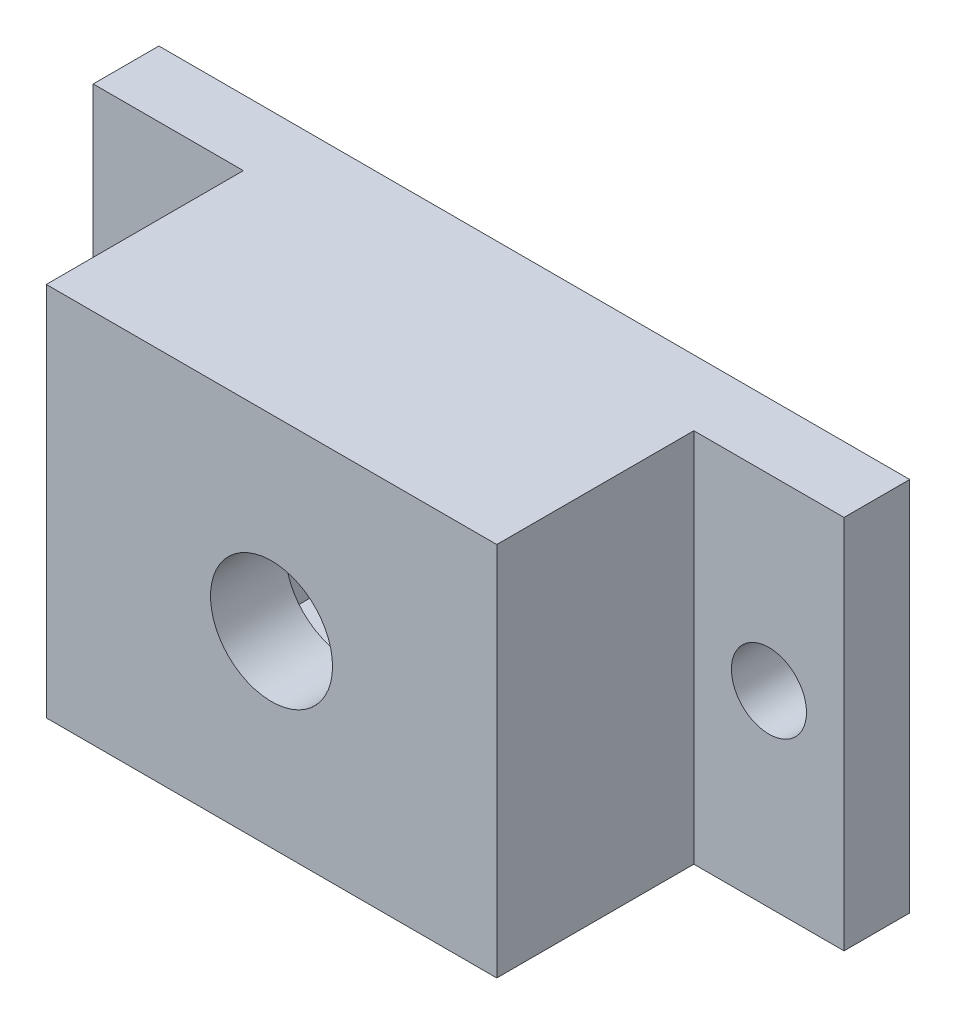
ISO-10303-21;
HEADER;
FILE_DESCRIPTION(('STEP AP214'),'2;1');
FILE_NAME('part.step','',(''),(''),'','','');
FILE_SCHEMA(('AUTOMOTIVE_DESIGN { 1 0 10303 214 1 1 1 1 }'));
ENDSEC;
DATA;
#1=APPLICATION_CONTEXT('core data for automotive mechanical design processes');
#2=APPLICATION_PROTOCOL_DEFINITION('international standard','automotive_design',2000,#1);
#3=PRODUCT_CONTEXT('',#1,'mechanical');
#4=PRODUCT('Part','Part','',(#3));
#5=PRODUCT_RELATED_PRODUCT_CATEGORY('part','',(#4));
#6=PRODUCT_DEFINITION_FORMATION('','',#4);
#7=PRODUCT_DEFINITION_CONTEXT('part definition',#1,'design');
#8=PRODUCT_DEFINITION('design','',#6,#7);
#9=PRODUCT_DEFINITION_SHAPE('','',#8);
#10=(LENGTH_UNIT() NAMED_UNIT(*) SI_UNIT(.MILLI.,.METRE.));
#11=(NAMED_UNIT(*) PLANE_ANGLE_UNIT() SI_UNIT($,.RADIAN.));
#12=(NAMED_UNIT(*) SI_UNIT($,.STERADIAN.) SOLID_ANGLE_UNIT());
#13=UNCERTAINTY_MEASURE_WITH_UNIT(LENGTH_MEASURE(1.E-05),#10,'distance_accuracy_value','');
#14=(GEOMETRIC_REPRESENTATION_CONTEXT(3) GLOBAL_UNCERTAINTY_ASSIGNED_CONTEXT((#13)) GLOBAL_UNIT_ASSIGNED_CONTEXT((#10,
#11,#12)) REPRESENTATION_CONTEXT('',''));
#15=CARTESIAN_POINT('',(0.,0.,0.));
#16=DIRECTION('',(0.,0.,1.));
#17=DIRECTION('',(1.,0.,0.));
#18=AXIS2_PLACEMENT_3D('',#15,#16,#17);
#19=CARTESIAN_POINT('',(0.,0.,3.5));
#20=DIRECTION('',(0.,0.,1.));
#21=DIRECTION('',(1.,0.,0.));
#22=AXIS2_PLACEMENT_3D('',#19,#20,#21);
#23=PLANE('',#22);
#24=DIRECTION('',(0.,-1.,0.));
#25=VECTOR('',#24,1.);
#26=CARTESIAN_POINT('',(-53.2000626386215,-3.59073182197579,3.5));
#27=LINE('',#26,#25);
#28=CARTESIAN_POINT('',(-53.2000626386215,16.4092681780242,3.5));
#29=VERTEX_POINT('',#28);
#30=CARTESIAN_POINT('',(-53.2000626386215,-3.59073182197579,3.5));
#31=VERTEX_POINT('',#30);
#32=EDGE_CURVE('E57',#29,#31,#27,.T.);
#33=ORIENTED_EDGE('',*,*,#32,.F.);
#34=DIRECTION('',(-1.,0.,0.));
#35=VECTOR('',#34,1.);
#36=CARTESIAN_POINT('',(-61.2000626386215,16.4092681780242,3.5));
#37=LINE('',#36,#35);
#38=CARTESIAN_POINT('',(-61.2000626386215,16.4092681780242,3.5));
#39=VERTEX_POINT('',#38);
#40=EDGE_CURVE('E210',#29,#39,#37,.T.);
#41=ORIENTED_EDGE('',*,*,#40,.T.);
#42=DIRECTION('',(0.,-1.,0.));
#43=VECTOR('',#42,1.);
#44=CARTESIAN_POINT('',(-61.2000626386215,16.4092681780242,3.5));
#45=LINE('',#44,#43);
#46=CARTESIAN_POINT('',(-61.2000626386215,-3.59073182197579,3.5));
#47=VERTEX_POINT('',#46);
#48=EDGE_CURVE('E201',#39,#47,#45,.T.);
#49=ORIENTED_EDGE('',*,*,#48,.T.);
#50=DIRECTION('',(1.,0.,0.));
#51=VECTOR('',#50,1.);
#52=CARTESIAN_POINT('',(-61.2000626386215,-3.59073182197579,3.5));
#53=LINE('',#52,#51);
#54=EDGE_CURVE('E206',#47,#31,#53,.T.);
#55=ORIENTED_EDGE('',*,*,#54,.T.);
#56=EDGE_LOOP('',(#33,#41,#49,#55));
#57=FACE_BOUND('',#56,.T.);
#58=CARTESIAN_POINT('',(-57.2000626386215,6.40926817802421,3.5));
#59=DIRECTION('',(0.,0.,1.));
#60=DIRECTION('',(1.,0.,0.));
#61=AXIS2_PLACEMENT_3D('',#58,#59,#60);
#62=CIRCLE('',#61,2.);
#63=CARTESIAN_POINT('',(-55.2000626386215,6.40926817802421,3.5));
#64=VERTEX_POINT('',#63);
#65=EDGE_CURVE('E195',#64,#64,#62,.T.);
#66=ORIENTED_EDGE('',*,*,#65,.F.);
#67=EDGE_LOOP('',(#66));
#68=FACE_BOUND('',#67,.T.);
#69=ADVANCED_FACE('F33',(#57,#68),#23,.T.);
#70=DIRECTION('',(0.,1.,0.));
#71=VECTOR('',#70,1.);
#72=CARTESIAN_POINT('',(-29.2000626386215,-3.59073182197579,3.5));
#73=LINE('',#72,#71);
#74=CARTESIAN_POINT('',(-29.2000626386215,-3.59073182197579,3.5));
#75=VERTEX_POINT('',#74);
#76=CARTESIAN_POINT('',(-29.2000626386215,16.4092681780242,3.5));
#77=VERTEX_POINT('',#76);
#78=EDGE_CURVE('E167',#75,#77,#73,.T.);
#79=ORIENTED_EDGE('',*,*,#78,.F.);
#80=CARTESIAN_POINT('',(-21.2000626386215,-3.59073182197579,3.5));
#81=VERTEX_POINT('',#80);
#82=EDGE_CURVE('E204',#75,#81,#53,.T.);
#83=ORIENTED_EDGE('',*,*,#82,.T.);
#84=DIRECTION('',(0.,1.,0.));
#85=VECTOR('',#84,1.);
#86=CARTESIAN_POINT('',(-21.2000626386215,16.4092681780242,3.5));
#87=LINE('',#86,#85);
#88=CARTESIAN_POINT('',(-21.2000626386215,16.4092681780242,3.5));
#89=VERTEX_POINT('',#88);
#90=EDGE_CURVE('E208',#81,#89,#87,.T.);
#91=ORIENTED_EDGE('',*,*,#90,.T.);
#92=EDGE_CURVE('E211',#89,#77,#37,.T.);
#93=ORIENTED_EDGE('',*,*,#92,.T.);
#94=EDGE_LOOP('',(#79,#83,#91,#93));
#95=FACE_BOUND('',#94,.T.);
#96=CARTESIAN_POINT('',(-25.2000626386215,6.40926817802421,3.5));
#97=DIRECTION('',(0.,0.,1.));
#98=DIRECTION('',(1.,0.,0.));
#99=AXIS2_PLACEMENT_3D('',#96,#97,#98);
#100=CIRCLE('',#99,2.);
#101=CARTESIAN_POINT('',(-23.2000626386215,6.40926817802421,3.5));
#102=VERTEX_POINT('',#101);
#103=EDGE_CURVE('E189',#102,#102,#100,.T.);
#104=ORIENTED_EDGE('',*,*,#103,.F.);
#105=EDGE_LOOP('',(#104));
#106=FACE_BOUND('',#105,.T.);
#107=ADVANCED_FACE('F262',(#95,#106),#23,.T.);
#108=CARTESIAN_POINT('',(0.,0.,0.));
#109=DIRECTION('',(0.,0.,1.));
#110=DIRECTION('',(1.,0.,0.));
#111=AXIS2_PLACEMENT_3D('',#108,#109,#110);
#112=PLANE('',#111);
#113=DIRECTION('',(1.,0.,0.));
#114=VECTOR('',#113,1.);
#115=CARTESIAN_POINT('',(-50.2000626386215,14.9092681780242,0.));
#116=LINE('',#115,#114);
#117=CARTESIAN_POINT('',(-50.2000626386215,14.9092681780242,0.));
#118=VERTEX_POINT('',#117);
#119=CARTESIAN_POINT('',(-32.2000626386215,14.9092681780242,0.));
#120=VERTEX_POINT('',#119);
#121=EDGE_CURVE('E154',#118,#120,#116,.T.);
#122=ORIENTED_EDGE('',*,*,#121,.F.);
#123=DIRECTION('',(0.,1.,0.));
#124=VECTOR('',#123,1.);
#125=CARTESIAN_POINT('',(-50.2000626386215,14.9092681780242,0.));
#126=LINE('',#125,#124);
#127=CARTESIAN_POINT('',(-50.2000626386215,-2.09073182197579,0.));
#128=VERTEX_POINT('',#127);
#129=EDGE_CURVE('E49',#128,#118,#126,.T.);
#130=ORIENTED_EDGE('',*,*,#129,.F.);
#131=DIRECTION('',(-1.,0.,0.));
#132=VECTOR('',#131,1.);
#133=CARTESIAN_POINT('',(-50.2000626386215,-2.09073182197579,0.));
#134=LINE('',#133,#132);
#135=CARTESIAN_POINT('',(-32.2000626386215,-2.0907318219758,0.));
#136=VERTEX_POINT('',#135);
#137=EDGE_CURVE('E143',#136,#128,#134,.T.);
#138=ORIENTED_EDGE('',*,*,#137,.F.);
#139=DIRECTION('',(0.,-1.,0.));
#140=VECTOR('',#139,1.);
#141=CARTESIAN_POINT('',(-32.2000626386215,14.9092681780242,0.));
#142=LINE('',#141,#140);
#143=EDGE_CURVE('E146',#120,#136,#142,.T.);
#144=ORIENTED_EDGE('',*,*,#143,.F.);
#145=EDGE_LOOP('',(#122,#130,#138,#144));
#146=FACE_BOUND('',#145,.T.);
#147=DIRECTION('',(0.,-1.,0.));
#148=VECTOR('',#147,1.);
#149=CARTESIAN_POINT('',(-61.2000626386215,16.4092681780242,0.));
#150=LINE('',#149,#148);
#151=CARTESIAN_POINT('',(-61.2000626386215,16.4092681780242,0.));
#152=VERTEX_POINT('',#151);
#153=CARTESIAN_POINT('',(-61.2000626386215,-3.59073182197579,0.));
#154=VERTEX_POINT('',#153);
#155=EDGE_CURVE('E198',#152,#154,#150,.T.);
#156=ORIENTED_EDGE('',*,*,#155,.F.);
#157=DIRECTION('',(-1.,0.,0.));
#158=VECTOR('',#157,1.);
#159=CARTESIAN_POINT('',(-61.2000626386215,16.4092681780242,0.));
#160=LINE('',#159,#158);
#161=CARTESIAN_POINT('',(-21.2000626386215,16.4092681780242,0.));
#162=VERTEX_POINT('',#161);
#163=EDGE_CURVE('E205',#162,#152,#160,.T.);
#164=ORIENTED_EDGE('',*,*,#163,.F.);
#165=DIRECTION('',(0.,1.,0.));
#166=VECTOR('',#165,1.);
#167=CARTESIAN_POINT('',(-21.2000626386215,16.4092681780242,0.));
#168=LINE('',#167,#166);
#169=CARTESIAN_POINT('',(-21.2000626386215,-3.59073182197579,0.));
#170=VERTEX_POINT('',#169);
#171=EDGE_CURVE('E218',#170,#162,#168,.T.);
#172=ORIENTED_EDGE('',*,*,#171,.F.);
#173=DIRECTION('',(1.,0.,0.));
#174=VECTOR('',#173,1.);
#175=CARTESIAN_POINT('',(-61.2000626386215,-3.59073182197579,0.));
#176=LINE('',#175,#174);
#177=EDGE_CURVE('E216',#154,#170,#176,.T.);
#178=ORIENTED_EDGE('',*,*,#177,.F.);
#179=EDGE_LOOP('',(#156,#164,#172,#178));
#180=FACE_BOUND('',#179,.T.);
#181=CARTESIAN_POINT('',(-57.2000626386215,6.40926817802421,0.));
#182=DIRECTION('',(0.,0.,1.));
#183=DIRECTION('',(1.,0.,0.));
#184=AXIS2_PLACEMENT_3D('',#181,#182,#183);
#185=CIRCLE('',#184,2.);
#186=CARTESIAN_POINT('',(-55.2000626386215,6.40926817802421,0.));
#187=VERTEX_POINT('',#186);
#188=EDGE_CURVE('E192',#187,#187,#185,.T.);
#189=ORIENTED_EDGE('',*,*,#188,.T.);
#190=EDGE_LOOP('',(#189));
#191=FACE_BOUND('',#190,.T.);
#192=CARTESIAN_POINT('',(-25.2000626386215,6.40926817802421,0.));
#193=DIRECTION('',(0.,0.,1.));
#194=DIRECTION('',(1.,0.,0.));
#195=AXIS2_PLACEMENT_3D('',#192,#193,#194);
#196=CIRCLE('',#195,2.);
#197=CARTESIAN_POINT('',(-23.2000626386215,6.40926817802421,0.));
#198=VERTEX_POINT('',#197);
#199=EDGE_CURVE('E188',#198,#198,#196,.T.);
#200=ORIENTED_EDGE('',*,*,#199,.T.);
#201=EDGE_LOOP('',(#200));
#202=FACE_BOUND('',#201,.T.);
#203=ADVANCED_FACE('F238',(#146,#180,#191,#202),#112,.F.);
#204=CARTESIAN_POINT('',(-61.2000626386215,16.4092681780242,3.5));
#205=DIRECTION('',(1.,0.,0.));
#206=DIRECTION('',(0.,0.,-1.));
#207=AXIS2_PLACEMENT_3D('',#204,#205,#206);
#208=PLANE('',#207);
#209=ORIENTED_EDGE('',*,*,#155,.T.);
#210=DIRECTION('',(0.,0.,-1.));
#211=VECTOR('',#210,1.);
#212=CARTESIAN_POINT('',(-61.2000626386215,-3.59073182197579,3.5));
#213=LINE('',#212,#211);
#214=EDGE_CURVE('E11',#47,#154,#213,.T.);
#215=ORIENTED_EDGE('',*,*,#214,.F.);
#216=ORIENTED_EDGE('',*,*,#48,.F.);
#217=DIRECTION('',(0.,0.,-1.));
#218=VECTOR('',#217,1.);
#219=CARTESIAN_POINT('',(-61.2000626386215,16.4092681780242,3.5));
#220=LINE('',#219,#218);
#221=EDGE_CURVE('E213',#39,#152,#220,.T.);
#222=ORIENTED_EDGE('',*,*,#221,.T.);
#223=EDGE_LOOP('',(#209,#215,#216,#222));
#224=FACE_BOUND('',#223,.T.);
#225=ADVANCED_FACE('F35',(#224),#208,.F.);
#226=CARTESIAN_POINT('',(-61.2000626386215,-3.59073182197579,3.5));
#227=DIRECTION('',(0.,1.,0.));
#228=DIRECTION('',(-1.,0.,0.));
#229=AXIS2_PLACEMENT_3D('',#226,#227,#228);
#230=PLANE('',#229);
#231=ORIENTED_EDGE('',*,*,#177,.T.);
#232=DIRECTION('',(0.,0.,-1.));
#233=VECTOR('',#232,1.);
#234=CARTESIAN_POINT('',(-21.2000626386215,-3.59073182197579,3.5));
#235=LINE('',#234,#233);
#236=EDGE_CURVE('E42',#81,#170,#235,.T.);
#237=ORIENTED_EDGE('',*,*,#236,.F.);
#238=ORIENTED_EDGE('',*,*,#82,.F.);
#239=DIRECTION('',(0.,0.,-1.));
#240=VECTOR('',#239,1.);
#241=CARTESIAN_POINT('',(-29.2000626386215,-3.59073182197579,14.));
#242=LINE('',#241,#240);
#243=CARTESIAN_POINT('',(-29.2000626386215,-3.59073182197579,14.));
#244=VERTEX_POINT('',#243);
#245=EDGE_CURVE('E182',#244,#75,#242,.T.);
#246=ORIENTED_EDGE('',*,*,#245,.F.);
#247=DIRECTION('',(1.,0.,0.));
#248=VECTOR('',#247,1.);
#249=CARTESIAN_POINT('',(-53.2000626386215,-3.59073182197579,14.));
#250=LINE('',#249,#248);
#251=CARTESIAN_POINT('',(-53.2000626386215,-3.59073182197579,14.));
#252=VERTEX_POINT('',#251);
#253=EDGE_CURVE('E166',#252,#244,#250,.T.);
#254=ORIENTED_EDGE('',*,*,#253,.F.);
#255=DIRECTION('',(0.,0.,-1.));
#256=VECTOR('',#255,1.);
#257=CARTESIAN_POINT('',(-53.2000626386215,-3.59073182197579,14.));
#258=LINE('',#257,#256);
#259=EDGE_CURVE('E185',#252,#31,#258,.T.);
#260=ORIENTED_EDGE('',*,*,#259,.T.);
#261=ORIENTED_EDGE('',*,*,#54,.F.);
#262=ORIENTED_EDGE('',*,*,#214,.T.);
#263=EDGE_LOOP('',(#231,#237,#238,#246,#254,#260,#261,#262));
#264=FACE_BOUND('',#263,.T.);
#265=ADVANCED_FACE('F264',(#264),#230,.F.);
#266=CARTESIAN_POINT('',(-21.2000626386215,16.4092681780242,3.5));
#267=DIRECTION('',(-1.,0.,0.));
#268=DIRECTION('',(0.,0.,1.));
#269=AXIS2_PLACEMENT_3D('',#266,#267,#268);
#270=PLANE('',#269);
#271=ORIENTED_EDGE('',*,*,#171,.T.);
#272=DIRECTION('',(0.,0.,-1.));
#273=VECTOR('',#272,1.);
#274=CARTESIAN_POINT('',(-21.2000626386215,16.4092681780242,3.5));
#275=LINE('',#274,#273);
#276=EDGE_CURVE('E223',#89,#162,#275,.T.);
#277=ORIENTED_EDGE('',*,*,#276,.F.);
#278=ORIENTED_EDGE('',*,*,#90,.F.);
#279=ORIENTED_EDGE('',*,*,#236,.T.);
#280=EDGE_LOOP('',(#271,#277,#278,#279));
#281=FACE_BOUND('',#280,.T.);
#282=ADVANCED_FACE('F231',(#281),#270,.F.);
#283=CARTESIAN_POINT('',(-61.2000626386215,16.4092681780242,3.5));
#284=DIRECTION('',(0.,-1.,0.));
#285=DIRECTION('',(0.,0.,-1.));
#286=AXIS2_PLACEMENT_3D('',#283,#284,#285);
#287=PLANE('',#286);
#288=ORIENTED_EDGE('',*,*,#163,.T.);
#289=ORIENTED_EDGE('',*,*,#221,.F.);
#290=ORIENTED_EDGE('',*,*,#40,.F.);
#291=DIRECTION('',(0.,0.,-1.));
#292=VECTOR('',#291,1.);
#293=CARTESIAN_POINT('',(-53.2000626386215,16.4092681780242,14.));
#294=LINE('',#293,#292);
#295=CARTESIAN_POINT('',(-53.2000626386215,16.4092681780242,14.));
#296=VERTEX_POINT('',#295);
#297=EDGE_CURVE('E173',#296,#29,#294,.T.);
#298=ORIENTED_EDGE('',*,*,#297,.F.);
#299=DIRECTION('',(-1.,0.,0.));
#300=VECTOR('',#299,1.);
#301=CARTESIAN_POINT('',(-53.2000626386215,16.4092681780242,14.));
#302=LINE('',#301,#300);
#303=CARTESIAN_POINT('',(-29.2000626386215,16.4092681780242,14.));
#304=VERTEX_POINT('',#303);
#305=EDGE_CURVE('E171',#304,#296,#302,.T.);
#306=ORIENTED_EDGE('',*,*,#305,.F.);
#307=DIRECTION('',(0.,0.,-1.));
#308=VECTOR('',#307,1.);
#309=CARTESIAN_POINT('',(-29.2000626386215,16.4092681780242,14.));
#310=LINE('',#309,#308);
#311=EDGE_CURVE('E179',#304,#77,#310,.T.);
#312=ORIENTED_EDGE('',*,*,#311,.T.);
#313=ORIENTED_EDGE('',*,*,#92,.F.);
#314=ORIENTED_EDGE('',*,*,#276,.T.);
#315=EDGE_LOOP('',(#288,#289,#290,#298,#306,#312,#313,#314));
#316=FACE_BOUND('',#315,.T.);
#317=ADVANCED_FACE('F242',(#316),#287,.F.);
#318=CARTESIAN_POINT('',(-57.2000626386215,6.40926817802421,3.5));
#319=DIRECTION('',(0.,0.,-1.));
#320=DIRECTION('',(-1.,0.,0.));
#321=AXIS2_PLACEMENT_3D('',#318,#319,#320);
#322=CYLINDRICAL_SURFACE('',#321,2.);
#323=ORIENTED_EDGE('',*,*,#65,.T.);
#324=EDGE_LOOP('',(#323));
#325=FACE_BOUND('',#324,.T.);
#326=ORIENTED_EDGE('',*,*,#188,.F.);
#327=EDGE_LOOP('',(#326));
#328=FACE_BOUND('',#327,.T.);
#329=ADVANCED_FACE('F278',(#325,#328),#322,.F.);
#330=CARTESIAN_POINT('',(-25.2000626386215,6.40926817802421,3.5));
#331=DIRECTION('',(0.,0.,-1.));
#332=DIRECTION('',(-1.,0.,0.));
#333=AXIS2_PLACEMENT_3D('',#330,#331,#332);
#334=CYLINDRICAL_SURFACE('',#333,2.);
#335=ORIENTED_EDGE('',*,*,#103,.T.);
#336=EDGE_LOOP('',(#335));
#337=FACE_BOUND('',#336,.T.);
#338=ORIENTED_EDGE('',*,*,#199,.F.);
#339=EDGE_LOOP('',(#338));
#340=FACE_BOUND('',#339,.T.);
#341=ADVANCED_FACE('F287',(#337,#340),#334,.F.);
#342=CARTESIAN_POINT('',(-53.2000626386215,-3.59073182197579,14.));
#343=DIRECTION('',(1.,0.,0.));
#344=DIRECTION('',(0.,0.,-1.));
#345=AXIS2_PLACEMENT_3D('',#342,#343,#344);
#346=PLANE('',#345);
#347=ORIENTED_EDGE('',*,*,#32,.T.);
#348=ORIENTED_EDGE('',*,*,#259,.F.);
#349=DIRECTION('',(0.,-1.,0.));
#350=VECTOR('',#349,1.);
#351=CARTESIAN_POINT('',(-53.2000626386215,-3.59073182197579,14.));
#352=LINE('',#351,#350);
#353=EDGE_CURVE('E163',#296,#252,#352,.T.);
#354=ORIENTED_EDGE('',*,*,#353,.F.);
#355=ORIENTED_EDGE('',*,*,#297,.T.);
#356=EDGE_LOOP('',(#347,#348,#354,#355));
#357=FACE_BOUND('',#356,.T.);
#358=ADVANCED_FACE('F252',(#357),#346,.F.);
#359=CARTESIAN_POINT('',(-29.2000626386215,-3.59073182197579,14.));
#360=DIRECTION('',(-1.,0.,0.));
#361=DIRECTION('',(0.,0.,1.));
#362=AXIS2_PLACEMENT_3D('',#359,#360,#361);
#363=PLANE('',#362);
#364=ORIENTED_EDGE('',*,*,#78,.T.);
#365=ORIENTED_EDGE('',*,*,#311,.F.);
#366=DIRECTION('',(0.,1.,0.));
#367=VECTOR('',#366,1.);
#368=CARTESIAN_POINT('',(-29.2000626386215,-3.59073182197579,14.));
#369=LINE('',#368,#367);
#370=EDGE_CURVE('E169',#244,#304,#369,.T.);
#371=ORIENTED_EDGE('',*,*,#370,.F.);
#372=ORIENTED_EDGE('',*,*,#245,.T.);
#373=EDGE_LOOP('',(#364,#365,#371,#372));
#374=FACE_BOUND('',#373,.T.);
#375=ADVANCED_FACE('F260',(#374),#363,.F.);
#376=CARTESIAN_POINT('',(0.,0.,14.));
#377=DIRECTION('',(0.,0.,-1.));
#378=DIRECTION('',(-1.,0.,0.));
#379=AXIS2_PLACEMENT_3D('',#376,#377,#378);
#380=PLANE('',#379);
#381=CARTESIAN_POINT('',(-41.2000626386215,6.40926817802421,14.));
#382=DIRECTION('',(0.,0.,1.));
#383=DIRECTION('',(1.,0.,0.));
#384=AXIS2_PLACEMENT_3D('',#381,#382,#383);
#385=CIRCLE('',#384,3.25);
#386=CARTESIAN_POINT('',(-37.9500626386215,6.40926817802421,14.));
#387=VERTEX_POINT('',#386);
#388=EDGE_CURVE('E149',#387,#387,#385,.T.);
#389=ORIENTED_EDGE('',*,*,#388,.F.);
#390=EDGE_LOOP('',(#389));
#391=FACE_BOUND('',#390,.T.);
#392=ORIENTED_EDGE('',*,*,#353,.T.);
#393=ORIENTED_EDGE('',*,*,#253,.T.);
#394=ORIENTED_EDGE('',*,*,#370,.T.);
#395=ORIENTED_EDGE('',*,*,#305,.T.);
#396=EDGE_LOOP('',(#392,#393,#394,#395));
#397=FACE_BOUND('',#396,.T.);
#398=ADVANCED_FACE('F255',(#391,#397),#380,.F.);
#399=CARTESIAN_POINT('',(-50.2000626386215,14.9092681780242,10.));
#400=DIRECTION('',(-1.,0.,0.));
#401=DIRECTION('',(0.,0.,1.));
#402=AXIS2_PLACEMENT_3D('',#399,#400,#401);
#403=PLANE('',#402);
#404=ORIENTED_EDGE('',*,*,#129,.T.);
#405=DIRECTION('',(0.,0.,-1.));
#406=VECTOR('',#405,1.);
#407=CARTESIAN_POINT('',(-50.2000626386215,14.9092681780242,10.));
#408=LINE('',#407,#406);
#409=CARTESIAN_POINT('',(-50.2000626386215,14.9092681780242,10.));
#410=VERTEX_POINT('',#409);
#411=EDGE_CURVE('E121',#410,#118,#408,.T.);
#412=ORIENTED_EDGE('',*,*,#411,.F.);
#413=DIRECTION('',(0.,1.,0.));
#414=VECTOR('',#413,1.);
#415=CARTESIAN_POINT('',(-50.2000626386215,14.9092681780242,10.));
#416=LINE('',#415,#414);
#417=CARTESIAN_POINT('',(-50.2000626386215,-2.09073182197579,10.));
#418=VERTEX_POINT('',#417);
#419=EDGE_CURVE('E125',#418,#410,#416,.T.);
#420=ORIENTED_EDGE('',*,*,#419,.F.);
#421=DIRECTION('',(0.,0.,-1.));
#422=VECTOR('',#421,1.);
#423=CARTESIAN_POINT('',(-50.2000626386215,-2.09073182197579,10.));
#424=LINE('',#423,#422);
#425=EDGE_CURVE('E158',#418,#128,#424,.T.);
#426=ORIENTED_EDGE('',*,*,#425,.T.);
#427=EDGE_LOOP('',(#404,#412,#420,#426));
#428=FACE_BOUND('',#427,.T.);
#429=ADVANCED_FACE('F123',(#428),#403,.F.);
#430=CARTESIAN_POINT('',(-50.2000626386215,-2.09073182197579,10.));
#431=DIRECTION('',(0.,-1.,0.));
#432=DIRECTION('',(1.,0.,0.));
#433=AXIS2_PLACEMENT_3D('',#430,#431,#432);
#434=PLANE('',#433);
#435=ORIENTED_EDGE('',*,*,#137,.T.);
#436=ORIENTED_EDGE('',*,*,#425,.F.);
#437=DIRECTION('',(-1.,0.,0.));
#438=VECTOR('',#437,1.);
#439=CARTESIAN_POINT('',(-50.2000626386215,-2.09073182197579,10.));
#440=LINE('',#439,#438);
#441=CARTESIAN_POINT('',(-32.2000626386215,-2.0907318219758,10.));
#442=VERTEX_POINT('',#441);
#443=EDGE_CURVE('E131',#442,#418,#440,.T.);
#444=ORIENTED_EDGE('',*,*,#443,.F.);
#445=DIRECTION('',(0.,0.,-1.));
#446=VECTOR('',#445,1.);
#447=CARTESIAN_POINT('',(-32.2000626386215,-2.0907318219758,10.));
#448=LINE('',#447,#446);
#449=EDGE_CURVE('E160',#442,#136,#448,.T.);
#450=ORIENTED_EDGE('',*,*,#449,.T.);
#451=EDGE_LOOP('',(#435,#436,#444,#450));
#452=FACE_BOUND('',#451,.T.);
#453=ADVANCED_FACE('F311',(#452),#434,.F.);
#454=CARTESIAN_POINT('',(-32.2000626386215,14.9092681780242,10.));
#455=DIRECTION('',(1.,0.,0.));
#456=DIRECTION('',(0.,0.,-1.));
#457=AXIS2_PLACEMENT_3D('',#454,#455,#456);
#458=PLANE('',#457);
#459=ORIENTED_EDGE('',*,*,#143,.T.);
#460=ORIENTED_EDGE('',*,*,#449,.F.);
#461=DIRECTION('',(0.,-1.,0.));
#462=VECTOR('',#461,1.);
#463=CARTESIAN_POINT('',(-32.2000626386215,14.9092681780242,10.));
#464=LINE('',#463,#462);
#465=CARTESIAN_POINT('',(-32.2000626386215,14.9092681780242,10.));
#466=VERTEX_POINT('',#465);
#467=EDGE_CURVE('E139',#466,#442,#464,.T.);
#468=ORIENTED_EDGE('',*,*,#467,.F.);
#469=DIRECTION('',(0.,0.,-1.));
#470=VECTOR('',#469,1.);
#471=CARTESIAN_POINT('',(-32.2000626386215,14.9092681780242,10.));
#472=LINE('',#471,#470);
#473=EDGE_CURVE('E130',#466,#120,#472,.T.);
#474=ORIENTED_EDGE('',*,*,#473,.T.);
#475=EDGE_LOOP('',(#459,#460,#468,#474));
#476=FACE_BOUND('',#475,.T.);
#477=ADVANCED_FACE('F314',(#476),#458,.F.);
#478=CARTESIAN_POINT('',(-50.2000626386215,14.9092681780242,10.));
#479=DIRECTION('',(0.,1.,0.));
#480=DIRECTION('',(0.,0.,1.));
#481=AXIS2_PLACEMENT_3D('',#478,#479,#480);
#482=PLANE('',#481);
#483=ORIENTED_EDGE('',*,*,#121,.T.);
#484=ORIENTED_EDGE('',*,*,#473,.F.);
#485=DIRECTION('',(1.,0.,0.));
#486=VECTOR('',#485,1.);
#487=CARTESIAN_POINT('',(-50.2000626386215,14.9092681780242,10.));
#488=LINE('',#487,#486);
#489=EDGE_CURVE('E134',#410,#466,#488,.T.);
#490=ORIENTED_EDGE('',*,*,#489,.F.);
#491=ORIENTED_EDGE('',*,*,#411,.T.);
#492=EDGE_LOOP('',(#483,#484,#490,#491));
#493=FACE_BOUND('',#492,.T.);
#494=ADVANCED_FACE('F135',(#493),#482,.F.);
#495=CARTESIAN_POINT('',(0.,0.,10.));
#496=DIRECTION('',(0.,0.,1.));
#497=DIRECTION('',(1.,0.,0.));
#498=AXIS2_PLACEMENT_3D('',#495,#496,#497);
#499=PLANE('',#498);
#500=CARTESIAN_POINT('',(-41.2000626386215,6.40926817802421,10.));
#501=DIRECTION('',(0.,0.,1.));
#502=DIRECTION('',(1.,0.,0.));
#503=AXIS2_PLACEMENT_3D('',#500,#501,#502);
#504=CIRCLE('',#503,3.25);
#505=CARTESIAN_POINT('',(-37.9500626386215,6.40926817802421,10.));
#506=VERTEX_POINT('',#505);
#507=EDGE_CURVE('E37',#506,#506,#504,.T.);
#508=ORIENTED_EDGE('',*,*,#507,.T.);
#509=EDGE_LOOP('',(#508));
#510=FACE_BOUND('',#509,.T.);
#511=ORIENTED_EDGE('',*,*,#419,.T.);
#512=ORIENTED_EDGE('',*,*,#489,.T.);
#513=ORIENTED_EDGE('',*,*,#467,.T.);
#514=ORIENTED_EDGE('',*,*,#443,.T.);
#515=EDGE_LOOP('',(#511,#512,#513,#514));
#516=FACE_BOUND('',#515,.T.);
#517=ADVANCED_FACE('F141',(#510,#516),#499,.F.);
#518=CARTESIAN_POINT('',(-41.2000626386215,6.40926817802421,0.));
#519=DIRECTION('',(0.,0.,1.));
#520=DIRECTION('',(1.,0.,0.));
#521=AXIS2_PLACEMENT_3D('',#518,#519,#520);
#522=CYLINDRICAL_SURFACE('',#521,3.25);
#523=ORIENTED_EDGE('',*,*,#388,.T.);
#524=EDGE_LOOP('',(#523));
#525=FACE_BOUND('',#524,.T.);
#526=ORIENTED_EDGE('',*,*,#507,.F.);
#527=EDGE_LOOP('',(#526));
#528=FACE_BOUND('',#527,.T.);
#529=ADVANCED_FACE('F323',(#525,#528),#522,.F.);
#530=CLOSED_SHELL('',(#69,#107,#203,#225,#265,#282,#317,#329,#341,#358,#375,#398,#429,#453,#477,
#494,#517,#529));
#531=MANIFOLD_SOLID_BREP('B2',#530);
#532=ADVANCED_BREP_SHAPE_REPRESENTATION('',(#18,#531),#14);
#533=SHAPE_DEFINITION_REPRESENTATION(#9,#532);
ENDSEC;
END-ISO-10303-21;
